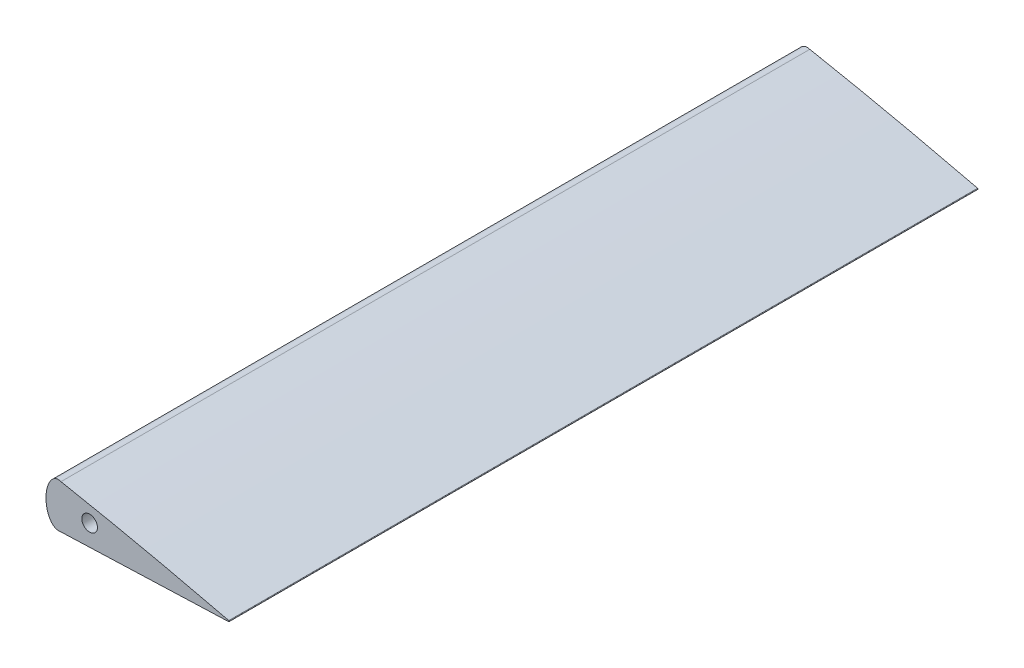
ISO-10303-21;
HEADER;
FILE_DESCRIPTION(('STEP AP214'),'2;1');
FILE_NAME('part.step','',(''),(''),'','','');
FILE_SCHEMA(('AUTOMOTIVE_DESIGN { 1 0 10303 214 1 1 1 1 }'));
ENDSEC;
DATA;
#1=APPLICATION_CONTEXT('core data for automotive mechanical design processes');
#2=APPLICATION_PROTOCOL_DEFINITION('international standard','automotive_design',2000,#1);
#3=PRODUCT_CONTEXT('',#1,'mechanical');
#4=PRODUCT('Part','Part','',(#3));
#5=PRODUCT_RELATED_PRODUCT_CATEGORY('part','',(#4));
#6=PRODUCT_DEFINITION_FORMATION('','',#4);
#7=PRODUCT_DEFINITION_CONTEXT('part definition',#1,'design');
#8=PRODUCT_DEFINITION('design','',#6,#7);
#9=PRODUCT_DEFINITION_SHAPE('','',#8);
#10=(LENGTH_UNIT() NAMED_UNIT(*) SI_UNIT(.MILLI.,.METRE.));
#11=(NAMED_UNIT(*) PLANE_ANGLE_UNIT() SI_UNIT($,.RADIAN.));
#12=(NAMED_UNIT(*) SI_UNIT($,.STERADIAN.) SOLID_ANGLE_UNIT());
#13=UNCERTAINTY_MEASURE_WITH_UNIT(LENGTH_MEASURE(1.E-05),#10,'distance_accuracy_value','');
#14=(GEOMETRIC_REPRESENTATION_CONTEXT(3) GLOBAL_UNCERTAINTY_ASSIGNED_CONTEXT((#13)) GLOBAL_UNIT_ASSIGNED_CONTEXT((#10,
#11,#12)) REPRESENTATION_CONTEXT('',''));
#15=CARTESIAN_POINT('',(0.,0.,0.));
#16=DIRECTION('',(0.,0.,1.));
#17=DIRECTION('',(1.,0.,0.));
#18=AXIS2_PLACEMENT_3D('',#15,#16,#17);
#19=CARTESIAN_POINT('',(164.,0.098236,1246.6));
#20=CARTESIAN_POINT('',(163.453347386671,0.227855350458952,1246.6));
#21=CARTESIAN_POINT('',(162.360115671758,0.487076620664547,1246.6));
#22=CARTESIAN_POINT('',(160.720174081031,0.8748027913242,1246.6));
#23=CARTESIAN_POINT('',(159.080335299599,1.2611135108875,1246.6));
#24=CARTESIAN_POINT('',(156.894331895889,1.77189659204999,1246.6));
#25=CARTESIAN_POINT('',(154.161962419369,2.40100802385925,1246.6));
#26=CARTESIAN_POINT('',(150.881840500926,3.1375256901344,1246.6));
#27=CARTESIAN_POINT('',(147.601664877829,3.85659449964915,1246.6));
#28=CARTESIAN_POINT('',(144.321701501382,4.55985226737601,1246.6));
#29=CARTESIAN_POINT('',(141.041699291482,5.24621809732109,1246.6));
#30=CARTESIAN_POINT('',(137.761756820069,5.91557197661805,1246.6));
#31=CARTESIAN_POINT('',(134.481686048208,6.56653427941028,1246.6));
#32=CARTESIAN_POINT('',(131.201761117117,7.19989778417141,1246.6));
#33=CARTESIAN_POINT('',(127.921667907918,7.81375356606383,1246.6));
#34=CARTESIAN_POINT('',(124.641700877236,8.40917183607385,1246.6));
#35=CARTESIAN_POINT('',(121.361597548386,8.98464976190136,1246.6));
#36=CARTESIAN_POINT('',(118.081600920828,9.54128435164297,1246.6));
#37=CARTESIAN_POINT('',(114.801560540038,10.0780590298297,1246.6));
#38=CARTESIAN_POINT('',(111.521600724131,10.5950345799163,1246.6));
#39=CARTESIAN_POINT('',(108.241713881351,11.0909646842955,1246.6));
#40=CARTESIAN_POINT('',(104.961715387484,11.5629261888805,1246.6));
#41=CARTESIAN_POINT('',(101.681785544589,12.0101669419683,1246.6));
#42=CARTESIAN_POINT('',(98.4017469245326,12.4297089334238,1246.6));
#43=CARTESIAN_POINT('',(95.1216630030627,12.8204998785934,1246.6));
#44=CARTESIAN_POINT('',(91.8415424202874,13.1818311954848,1246.6));
#45=CARTESIAN_POINT('',(88.5614135801748,13.5136296911863,1246.6));
#46=CARTESIAN_POINT('',(85.2812830129089,13.815893693455,1246.6));
#47=CARTESIAN_POINT('',(82.0011692178232,14.0886945475444,1246.6));
#48=CARTESIAN_POINT('',(78.721094583004,14.3317408411769,1246.6));
#49=CARTESIAN_POINT('',(75.4410212023817,14.5431745258036,1246.6));
#50=CARTESIAN_POINT('',(72.1608949429442,14.7199129290163,1246.6));
#51=CARTESIAN_POINT('',(68.8807258367621,14.8594278594699,1246.6));
#52=CARTESIAN_POINT('',(65.6005029177586,14.9591611868157,1246.6));
#53=CARTESIAN_POINT('',(62.3202248877231,15.0161184911894,1246.6));
#54=CARTESIAN_POINT('',(59.0399904849592,15.0330111129914,1246.6));
#55=CARTESIAN_POINT('',(55.7598149007794,15.012803506004,1246.6));
#56=CARTESIAN_POINT('',(52.4796814465771,14.9596338867567,1246.6));
#57=CARTESIAN_POINT('',(49.1996020231385,14.8756453845849,1246.6));
#58=CARTESIAN_POINT('',(45.9192330465041,14.7668246976276,1246.6));
#59=CARTESIAN_POINT('',(42.6385376039657,14.6188266715463,1246.6));
#60=CARTESIAN_POINT('',(39.3574161799392,14.4160226283782,1246.6));
#61=CARTESIAN_POINT('',(36.0757975000136,14.1416033611045,1246.6));
#62=CARTESIAN_POINT('',(32.7935336386632,13.7797355777745,1246.6));
#63=CARTESIAN_POINT('',(29.5117490863587,13.311848816541,1246.6));
#64=CARTESIAN_POINT('',(26.2304347877456,12.7369411502886,1246.6));
#65=CARTESIAN_POINT('',(22.9482106391067,12.0590867159985,1246.6));
#66=CARTESIAN_POINT('',(19.6639743780453,11.2714313088833,1246.6));
#67=CARTESIAN_POINT('',(16.3781154279843,10.3517379968201,1246.6));
#68=CARTESIAN_POINT('',(13.0927390351379,9.27164991130654,1246.6));
#69=CARTESIAN_POINT('',(10.3581556975564,8.23985590536731,1246.6));
#70=CARTESIAN_POINT('',(8.17874341440028,7.26915270171108,1246.6));
#71=CARTESIAN_POINT('',(6.52711920655236,6.42362871815544,1246.6));
#72=CARTESIAN_POINT('',(4.8606326051585,5.41901455288728,1246.6));
#73=CARTESIAN_POINT('',(3.32216784213193,4.2467281999024,1246.6));
#74=CARTESIAN_POINT('',(2.16677990383352,3.13421853144612,1246.6));
#75=CARTESIAN_POINT('',(1.28484362701116,2.24003834899123,1246.6));
#76=CARTESIAN_POINT('',(0.72477847607304,1.58632625202643,1246.6));
#77=CARTESIAN_POINT('',(0.35648721556683,1.02371456627432,1246.6));
#78=CARTESIAN_POINT('',(0.176338644180926,0.655158851073157,1246.6));
#79=CARTESIAN_POINT('',(0.0612611395106372,0.337632955086773,1246.6));
#80=CARTESIAN_POINT('',(-0.0429121865202662,-0.121140296790297,1246.6));
#81=CARTESIAN_POINT('',(0.010077208925072,-0.598533270573657,1246.6));
#82=CARTESIAN_POINT('',(0.176198667745624,-1.01407787652228,1246.6));
#83=CARTESIAN_POINT('',(0.354673421549138,-1.34452507475123,1246.6));
#84=CARTESIAN_POINT('',(0.717110179714685,-1.82624030553599,1246.6));
#85=CARTESIAN_POINT('',(1.26977260153434,-2.33677484867151,1246.6));
#86=CARTESIAN_POINT('',(2.13175393776129,-2.92020441398472,1246.6));
#87=CARTESIAN_POINT('',(3.35494447776376,-3.3927891066928,1246.6));
#88=CARTESIAN_POINT('',(4.91531848514269,-3.70716670555496,1246.6));
#89=CARTESIAN_POINT('',(6.55415647727891,-4.03304969461932,1246.6));
#90=CARTESIAN_POINT('',(8.19533877766632,-4.28351567057608,1246.6));
#91=CARTESIAN_POINT('',(10.3822695733583,-4.51540047764127,1246.6));
#92=CARTESIAN_POINT('',(13.1186249251783,-4.67265304154677,1246.6));
#93=CARTESIAN_POINT('',(16.3988579729893,-4.82847557553279,1246.6));
#94=CARTESIAN_POINT('',(19.6794940200121,-4.9221269224633,1246.6));
#95=CARTESIAN_POINT('',(22.9598439452861,-4.96653444382741,1246.6));
#96=CARTESIAN_POINT('',(26.2400949207719,-4.9678853332589,1246.6));
#97=CARTESIAN_POINT('',(29.5202180796211,-4.93284058420912,1246.6));
#98=CARTESIAN_POINT('',(32.8002579900583,-4.8689493564345,1246.6));
#99=CARTESIAN_POINT('',(36.080251417321,-4.78267153882756,1246.6));
#100=CARTESIAN_POINT('',(39.360205991376,-4.67900202490651,1246.6));
#101=CARTESIAN_POINT('',(42.6401302310176,-4.56299213669189,1246.6));
#102=CARTESIAN_POINT('',(45.9200507833793,-4.43994519774915,1246.6));
#103=CARTESIAN_POINT('',(49.1999634238303,-4.31409585740894,1246.6));
#104=CARTESIAN_POINT('',(52.479955348434,-4.19074867403074,1246.6));
#105=CARTESIAN_POINT('',(55.7599812015837,-4.07002215466733,1246.6));
#106=CARTESIAN_POINT('',(59.0399831910091,-3.95007972297037,1246.6));
#107=CARTESIAN_POINT('',(62.3200043820552,-3.83126992795704,1246.6));
#108=CARTESIAN_POINT('',(65.6000091855952,-3.71206420486596,1246.6));
#109=CARTESIAN_POINT('',(68.8800086095087,-3.59232744073866,1246.6));
#110=CARTESIAN_POINT('',(72.1600102889574,-3.47216006055257,1246.6));
#111=CARTESIAN_POINT('',(75.4399983284211,-3.35129455058597,1246.6));
#112=CARTESIAN_POINT('',(78.7200044224965,-3.23070144154958,1246.6));
#113=CARTESIAN_POINT('',(81.9999960438394,-3.10971523913052,1246.6));
#114=CARTESIAN_POINT('',(85.2799973322548,-2.98904612003693,1246.6));
#115=CARTESIAN_POINT('',(88.5599965582764,-2.86848494516658,1246.6));
#116=CARTESIAN_POINT('',(91.8400003924801,-2.74815868844688,1246.6));
#117=CARTESIAN_POINT('',(95.1199998668713,-2.62776837459643,1246.6));
#118=CARTESIAN_POINT('',(98.4000001400348,-2.50739981316743,1246.6));
#119=CARTESIAN_POINT('',(101.67999957299,-2.38700837273386,1246.6));
#120=CARTESIAN_POINT('',(104.960003572939,-2.26668662234937,1246.6));
#121=CARTESIAN_POINT('',(108.240000169761,-2.14610862248626,1246.6));
#122=CARTESIAN_POINT('',(111.519995748018,-2.02550288772255,1246.6));
#123=CARTESIAN_POINT('',(114.80000480859,-1.90526426839036,1246.6));
#124=CARTESIAN_POINT('',(118.079995042267,-1.78456767053152,1246.6));
#125=CARTESIAN_POINT('',(121.360004997696,-1.66435341763084,1246.6));
#126=CARTESIAN_POINT('',(124.639994991596,-1.54365029078787,1246.6));
#127=CARTESIAN_POINT('',(127.920005011275,-1.42343778737223,1246.6));
#128=CARTESIAN_POINT('',(131.199994987952,-1.30273419156792,1246.6));
#129=CARTESIAN_POINT('',(134.480005012271,-1.18252181451118,1246.6));
#130=CARTESIAN_POINT('',(137.759994987609,-1.06181818223221,1246.6));
#131=CARTESIAN_POINT('',(141.040005012646,-0.941605824715075,1246.6));
#132=CARTESIAN_POINT('',(144.319994986453,-0.820902150752307,1246.6));
#133=CARTESIAN_POINT('',(147.600005016897,-0.700689940430646,1246.6));
#134=CARTESIAN_POINT('',(150.879994970606,-0.579985719369323,1246.6));
#135=CARTESIAN_POINT('',(154.160005076031,-0.459775550244729,1246.6));
#136=CARTESIAN_POINT('',(156.893330138421,-0.359182338982628,1246.6));
#137=CARTESIAN_POINT('',(159.080000324789,-0.278972841706895,1246.6));
#138=CARTESIAN_POINT('',(160.719999512133,-0.218762723666091,1246.6));
#139=CARTESIAN_POINT('',(162.360003632975,-0.15863219006814,1246.6));
#140=CARTESIAN_POINT('',(163.453333875564,-0.118368087984547,1246.6));
#141=CARTESIAN_POINT('',(164.,-0.098236,1246.6));
#142=B_SPLINE_CURVE_WITH_KNOTS('',3,(#19,#20,#21,#22,#23,#24,#25,#26,#27,#28,#29,#30,#31,#32,
#33,#34,#35,#36,#37,#38,#39,#40,#41,#42,#43,#44,#45,#46,#47,#48,#49,#50,#51,#52,#53,#54,#55,#56,
#57,#58,#59,#60,#61,#62,#63,#64,#65,#66,#67,#68,#69,#70,#71,#72,#73,#74,#75,#76,#77,#78,#79,#80,
#81,#82,#83,#84,#85,#86,#87,#88,#89,#90,#91,#92,#93,#94,#95,#96,#97,#98,#99,#100,#101,#102,#103,
#104,#105,#106,#107,#108,#109,#110,#111,#112,#113,#114,#115,#116,#117,#118,#119,#120,#121,#122,
#123,#124,#125,#126,#127,#128,#129,#130,#131,#132,#133,#134,#135,#136,#137,#138,#139,#140,#141),
.UNSPECIFIED.,.F.,.F.,(4,1,1,1,1,1,1,1,1,1,1,1,1,1,1,1,1,1,1,1,1,1,1,1,1,1,1,1,1,1,1,1,1,1,1,1,
1,1,1,1,1,1,1,1,1,1,1,1,1,1,1,1,1,1,1,1,1,1,1,1,1,1,1,1,1,1,1,1,1,1,1,1,1,1,1,1,1,1,1,1,1,1,1,1,
1,1,1,1,1,1,1,1,1,1,1,1,1,1,1,1,1,1,1,1,1,1,1,1,1,1,1,1,1,1,1,1,1,1,1,1,4),(0.,
0.00502783507920503,0.0100549940344634,0.0150810297240759,0.0201050549080901,0.0301452607809432,
0.0401736458927437,0.0501907944797704,0.060197679895013,0.0701942255550732,0.0801803766412489,
0.0901559102827991,0.100121105793046,0.110075702815163,0.120020101260909,0.12995427083149,
0.139878706126609,0.149793490904472,0.159698811392375,0.169594433213407,0.179479778460019,
0.189354743837751,0.199219015443769,0.209072795450207,0.218916602866618,0.228751158154273,
0.238577241843568,0.248395636485294,0.258207018047657,0.268011852233636,0.277810604067606,
0.28760402315173,0.297393126728297,0.30717925271197,0.316964017963334,0.326748818989175,
0.336534714870927,0.346322473718417,0.356112722227348,0.365907651807351,0.375711463271153,
0.385530878969925,0.395375762487733,0.405259304622106,0.415192461064141,0.425184025337781,
0.435248335040234,0.445412190892236,0.455710778825161,0.466190958855658,0.471552192168147,
0.477054503678275,0.482786726573929,0.488945835105149,0.494316032866102,0.497126416153154,
0.500187367762256,0.50200086881537,0.50312820232303,0.503849971017213,0.505020136520667,
0.507317904862695,0.507986558007653,0.509023585585765,0.510668218535329,0.513358347504693,
0.515715811851598,0.519949385272463,0.524973187970153,0.529954400275476,0.534903201933464,
0.539824122915189,0.549630394385822,0.559425368878799,0.569214167199772,0.578999733437889,
0.588784364017046,0.598569510856094,0.608355932640458,0.618143879841103,0.627933314763685,
0.637723968115275,0.647515400204077,0.657307127187741,0.667098669129828,0.676889956114584,
0.68668111741491,0.69647218967302,0.706263279690747,0.716054423133804,0.725845620221906,
0.735636871174765,0.745428122127623,0.755219391084224,0.765010642037082,0.774801875010609,
0.784593090029218,0.794384305047826,0.804175520066435,0.813966735085043,0.823757950103652,
0.833549183077179,0.843340416050707,0.853131631069315,0.862922864042843,0.872714079061451,
0.882505312034978,0.892296527053587,0.902087760027114,0.911878975045723,0.92167020801925,
0.931461423037859,0.941252656011386,0.951043871029995,0.960835104003522,0.970626319022131,
0.980417551995658,0.985313159504962,0.990208767014267,0.995104374523571,1.),.UNSPECIFIED.);
#143=DIRECTION('',(0.,0.,-1.));
#144=VECTOR('',#143,1.);
#145=SURFACE_OF_LINEAR_EXTRUSION('',#142,#144);
#146=CARTESIAN_POINT('',(164.,0.098236,0.));
#147=CARTESIAN_POINT('',(163.453347386671,0.227855350458952,0.));
#148=CARTESIAN_POINT('',(162.360115671758,0.487076620664547,0.));
#149=CARTESIAN_POINT('',(160.720174081031,0.8748027913242,0.));
#150=CARTESIAN_POINT('',(159.080335299599,1.2611135108875,0.));
#151=CARTESIAN_POINT('',(156.894331895889,1.77189659204999,0.));
#152=CARTESIAN_POINT('',(154.161962419369,2.40100802385925,0.));
#153=CARTESIAN_POINT('',(150.881840500926,3.1375256901344,0.));
#154=CARTESIAN_POINT('',(147.601664877829,3.85659449964915,0.));
#155=CARTESIAN_POINT('',(144.321701501382,4.55985226737601,0.));
#156=CARTESIAN_POINT('',(141.041699291482,5.24621809732109,0.));
#157=CARTESIAN_POINT('',(137.761756820069,5.91557197661805,0.));
#158=CARTESIAN_POINT('',(134.481686048208,6.56653427941028,0.));
#159=CARTESIAN_POINT('',(131.201761117117,7.19989778417141,0.));
#160=CARTESIAN_POINT('',(127.921667907918,7.81375356606383,0.));
#161=CARTESIAN_POINT('',(124.641700877236,8.40917183607385,0.));
#162=CARTESIAN_POINT('',(121.361597548386,8.98464976190136,0.));
#163=CARTESIAN_POINT('',(118.081600920828,9.54128435164297,0.));
#164=CARTESIAN_POINT('',(114.801560540038,10.0780590298297,0.));
#165=CARTESIAN_POINT('',(111.521600724131,10.5950345799163,0.));
#166=CARTESIAN_POINT('',(108.241713881351,11.0909646842955,0.));
#167=CARTESIAN_POINT('',(104.961715387484,11.5629261888805,0.));
#168=CARTESIAN_POINT('',(101.681785544589,12.0101669419683,0.));
#169=CARTESIAN_POINT('',(98.4017469245326,12.4297089334238,0.));
#170=CARTESIAN_POINT('',(95.1216630030627,12.8204998785934,0.));
#171=CARTESIAN_POINT('',(91.8415424202874,13.1818311954848,0.));
#172=CARTESIAN_POINT('',(88.5614135801748,13.5136296911863,0.));
#173=CARTESIAN_POINT('',(85.2812830129089,13.815893693455,0.));
#174=CARTESIAN_POINT('',(82.0011692178232,14.0886945475444,0.));
#175=CARTESIAN_POINT('',(78.721094583004,14.3317408411769,0.));
#176=CARTESIAN_POINT('',(75.4410212023817,14.5431745258036,0.));
#177=CARTESIAN_POINT('',(72.1608949429442,14.7199129290163,0.));
#178=CARTESIAN_POINT('',(68.8807258367621,14.8594278594699,0.));
#179=CARTESIAN_POINT('',(65.6005029177586,14.9591611868157,0.));
#180=CARTESIAN_POINT('',(62.3202248877231,15.0161184911894,0.));
#181=CARTESIAN_POINT('',(59.0399904849592,15.0330111129914,0.));
#182=CARTESIAN_POINT('',(55.7598149007794,15.012803506004,0.));
#183=CARTESIAN_POINT('',(52.4796814465771,14.9596338867567,0.));
#184=CARTESIAN_POINT('',(49.1996020231385,14.8756453845849,0.));
#185=CARTESIAN_POINT('',(45.9192330465041,14.7668246976276,0.));
#186=CARTESIAN_POINT('',(42.6385376039657,14.6188266715463,0.));
#187=CARTESIAN_POINT('',(39.3574161799392,14.4160226283782,0.));
#188=CARTESIAN_POINT('',(36.0757975000136,14.1416033611045,0.));
#189=CARTESIAN_POINT('',(32.7935336386632,13.7797355777745,0.));
#190=CARTESIAN_POINT('',(29.5117490863587,13.311848816541,0.));
#191=CARTESIAN_POINT('',(26.2304347877456,12.7369411502886,0.));
#192=CARTESIAN_POINT('',(22.9482106391067,12.0590867159985,0.));
#193=CARTESIAN_POINT('',(19.6639743780453,11.2714313088833,0.));
#194=CARTESIAN_POINT('',(16.3781154279843,10.3517379968201,0.));
#195=CARTESIAN_POINT('',(13.0927390351379,9.27164991130654,0.));
#196=CARTESIAN_POINT('',(10.3581556975564,8.23985590536731,0.));
#197=CARTESIAN_POINT('',(8.17874341440028,7.26915270171108,0.));
#198=CARTESIAN_POINT('',(6.52711920655236,6.42362871815544,0.));
#199=CARTESIAN_POINT('',(4.8606326051585,5.41901455288728,0.));
#200=CARTESIAN_POINT('',(3.32216784213193,4.2467281999024,0.));
#201=CARTESIAN_POINT('',(2.16677990383352,3.13421853144612,0.));
#202=CARTESIAN_POINT('',(1.28484362701116,2.24003834899123,0.));
#203=CARTESIAN_POINT('',(0.72477847607304,1.58632625202643,0.));
#204=CARTESIAN_POINT('',(0.35648721556683,1.02371456627432,0.));
#205=CARTESIAN_POINT('',(0.176338644180926,0.655158851073157,0.));
#206=CARTESIAN_POINT('',(0.0612611395106372,0.337632955086773,0.));
#207=CARTESIAN_POINT('',(-0.0429121865202662,-0.121140296790297,0.));
#208=CARTESIAN_POINT('',(0.010077208925072,-0.598533270573657,0.));
#209=CARTESIAN_POINT('',(0.176198667745624,-1.01407787652228,0.));
#210=CARTESIAN_POINT('',(0.354673421549138,-1.34452507475123,0.));
#211=CARTESIAN_POINT('',(0.717110179714685,-1.82624030553599,0.));
#212=CARTESIAN_POINT('',(1.26977260153434,-2.33677484867151,0.));
#213=CARTESIAN_POINT('',(2.13175393776129,-2.92020441398472,0.));
#214=CARTESIAN_POINT('',(3.35494447776376,-3.3927891066928,0.));
#215=CARTESIAN_POINT('',(4.91531848514269,-3.70716670555496,0.));
#216=CARTESIAN_POINT('',(6.55415647727891,-4.03304969461932,0.));
#217=CARTESIAN_POINT('',(8.19533877766632,-4.28351567057608,0.));
#218=CARTESIAN_POINT('',(10.3822695733583,-4.51540047764127,0.));
#219=CARTESIAN_POINT('',(13.1186249251783,-4.67265304154677,0.));
#220=CARTESIAN_POINT('',(16.3988579729893,-4.82847557553279,0.));
#221=CARTESIAN_POINT('',(19.6794940200121,-4.9221269224633,0.));
#222=CARTESIAN_POINT('',(22.9598439452861,-4.96653444382741,0.));
#223=CARTESIAN_POINT('',(26.2400949207719,-4.9678853332589,0.));
#224=CARTESIAN_POINT('',(29.5202180796211,-4.93284058420912,0.));
#225=CARTESIAN_POINT('',(32.8002579900583,-4.8689493564345,0.));
#226=CARTESIAN_POINT('',(36.080251417321,-4.78267153882756,0.));
#227=CARTESIAN_POINT('',(39.360205991376,-4.67900202490651,0.));
#228=CARTESIAN_POINT('',(42.6401302310176,-4.56299213669189,0.));
#229=CARTESIAN_POINT('',(45.9200507833793,-4.43994519774915,0.));
#230=CARTESIAN_POINT('',(49.1999634238303,-4.31409585740894,0.));
#231=CARTESIAN_POINT('',(52.479955348434,-4.19074867403074,0.));
#232=CARTESIAN_POINT('',(55.7599812015837,-4.07002215466733,0.));
#233=CARTESIAN_POINT('',(59.0399831910091,-3.95007972297037,0.));
#234=CARTESIAN_POINT('',(62.3200043820552,-3.83126992795704,0.));
#235=CARTESIAN_POINT('',(65.6000091855952,-3.71206420486596,0.));
#236=CARTESIAN_POINT('',(68.8800086095087,-3.59232744073866,0.));
#237=CARTESIAN_POINT('',(72.1600102889574,-3.47216006055257,0.));
#238=CARTESIAN_POINT('',(75.4399983284211,-3.35129455058597,0.));
#239=CARTESIAN_POINT('',(78.7200044224965,-3.23070144154958,0.));
#240=CARTESIAN_POINT('',(81.9999960438394,-3.10971523913052,0.));
#241=CARTESIAN_POINT('',(85.2799973322548,-2.98904612003693,0.));
#242=CARTESIAN_POINT('',(88.5599965582764,-2.86848494516658,0.));
#243=CARTESIAN_POINT('',(91.8400003924801,-2.74815868844688,0.));
#244=CARTESIAN_POINT('',(95.1199998668713,-2.62776837459643,0.));
#245=CARTESIAN_POINT('',(98.4000001400348,-2.50739981316743,0.));
#246=CARTESIAN_POINT('',(101.67999957299,-2.38700837273386,0.));
#247=CARTESIAN_POINT('',(104.960003572939,-2.26668662234937,0.));
#248=CARTESIAN_POINT('',(108.240000169761,-2.14610862248626,0.));
#249=CARTESIAN_POINT('',(111.519995748018,-2.02550288772255,0.));
#250=CARTESIAN_POINT('',(114.80000480859,-1.90526426839036,0.));
#251=CARTESIAN_POINT('',(118.079995042267,-1.78456767053152,0.));
#252=CARTESIAN_POINT('',(121.360004997696,-1.66435341763084,0.));
#253=CARTESIAN_POINT('',(124.639994991596,-1.54365029078787,0.));
#254=CARTESIAN_POINT('',(127.920005011275,-1.42343778737223,0.));
#255=CARTESIAN_POINT('',(131.199994987952,-1.30273419156792,0.));
#256=CARTESIAN_POINT('',(134.480005012271,-1.18252181451118,0.));
#257=CARTESIAN_POINT('',(137.759994987609,-1.06181818223221,0.));
#258=CARTESIAN_POINT('',(141.040005012646,-0.941605824715075,0.));
#259=CARTESIAN_POINT('',(144.319994986453,-0.820902150752307,0.));
#260=CARTESIAN_POINT('',(147.600005016897,-0.700689940430646,0.));
#261=CARTESIAN_POINT('',(150.879994970606,-0.579985719369323,0.));
#262=CARTESIAN_POINT('',(154.160005076031,-0.459775550244729,0.));
#263=CARTESIAN_POINT('',(156.893330138421,-0.359182338982628,0.));
#264=CARTESIAN_POINT('',(159.080000324789,-0.278972841706895,0.));
#265=CARTESIAN_POINT('',(160.719999512133,-0.218762723666091,0.));
#266=CARTESIAN_POINT('',(162.360003632975,-0.15863219006814,0.));
#267=CARTESIAN_POINT('',(163.453333875564,-0.118368087984547,0.));
#268=CARTESIAN_POINT('',(164.,-0.098236,0.));
#269=B_SPLINE_CURVE_WITH_KNOTS('',3,(#146,#147,#148,#149,#150,#151,#152,#153,#154,#155,#156,
#157,#158,#159,#160,#161,#162,#163,#164,#165,#166,#167,#168,#169,#170,#171,#172,#173,#174,#175,
#176,#177,#178,#179,#180,#181,#182,#183,#184,#185,#186,#187,#188,#189,#190,#191,#192,#193,#194,
#195,#196,#197,#198,#199,#200,#201,#202,#203,#204,#205,#206,#207,#208,#209,#210,#211,#212,#213,
#214,#215,#216,#217,#218,#219,#220,#221,#222,#223,#224,#225,#226,#227,#228,#229,#230,#231,#232,
#233,#234,#235,#236,#237,#238,#239,#240,#241,#242,#243,#244,#245,#246,#247,#248,#249,#250,#251,
#252,#253,#254,#255,#256,#257,#258,#259,#260,#261,#262,#263,#264,#265,#266,#267,#268),
.UNSPECIFIED.,.F.,.F.,(4,1,1,1,1,1,1,1,1,1,1,1,1,1,1,1,1,1,1,1,1,1,1,1,1,1,1,1,1,1,1,1,1,1,1,1,
1,1,1,1,1,1,1,1,1,1,1,1,1,1,1,1,1,1,1,1,1,1,1,1,1,1,1,1,1,1,1,1,1,1,1,1,1,1,1,1,1,1,1,1,1,1,1,1,
1,1,1,1,1,1,1,1,1,1,1,1,1,1,1,1,1,1,1,1,1,1,1,1,1,1,1,1,1,1,1,1,1,1,1,1,4),(0.,
0.00502783507920503,0.0100549940344634,0.0150810297240759,0.0201050549080901,0.0301452607809432,
0.0401736458927437,0.0501907944797704,0.060197679895013,0.0701942255550732,0.0801803766412489,
0.0901559102827991,0.100121105793046,0.110075702815163,0.120020101260909,0.12995427083149,
0.139878706126609,0.149793490904472,0.159698811392375,0.169594433213407,0.179479778460019,
0.189354743837751,0.199219015443769,0.209072795450207,0.218916602866618,0.228751158154273,
0.238577241843568,0.248395636485294,0.258207018047657,0.268011852233636,0.277810604067606,
0.28760402315173,0.297393126728297,0.30717925271197,0.316964017963334,0.326748818989175,
0.336534714870927,0.346322473718417,0.356112722227348,0.365907651807351,0.375711463271153,
0.385530878969925,0.395375762487733,0.405259304622106,0.415192461064141,0.425184025337781,
0.435248335040234,0.445412190892236,0.455710778825161,0.466190958855658,0.471552192168147,
0.477054503678275,0.482786726573929,0.488945835105149,0.494316032866102,0.497126416153154,
0.500187367762256,0.50200086881537,0.50312820232303,0.503849971017213,0.505020136520667,
0.507317904862695,0.507986558007653,0.509023585585765,0.510668218535329,0.513358347504693,
0.515715811851598,0.519949385272463,0.524973187970153,0.529954400275476,0.534903201933464,
0.539824122915189,0.549630394385822,0.559425368878799,0.569214167199772,0.578999733437889,
0.588784364017046,0.598569510856094,0.608355932640458,0.618143879841103,0.627933314763685,
0.637723968115275,0.647515400204077,0.657307127187741,0.667098669129828,0.676889956114584,
0.68668111741491,0.69647218967302,0.706263279690747,0.716054423133804,0.725845620221906,
0.735636871174765,0.745428122127623,0.755219391084224,0.765010642037082,0.774801875010609,
0.784593090029218,0.794384305047826,0.804175520066435,0.813966735085043,0.823757950103652,
0.833549183077179,0.843340416050707,0.853131631069315,0.862922864042843,0.872714079061451,
0.882505312034978,0.892296527053587,0.902087760027114,0.911878975045723,0.92167020801925,
0.931461423037859,0.941252656011386,0.951043871029995,0.960835104003522,0.970626319022131,
0.980417551995658,0.985313159504962,0.990208767014267,0.995104374523571,1.),.UNSPECIFIED.);
#270=CARTESIAN_POINT('',(164.,0.098236,0.));
#271=VERTEX_POINT('',#270);
#272=CARTESIAN_POINT('',(131.781518308133,7.08611175598654,0.));
#273=VERTEX_POINT('',#272);
#274=EDGE_CURVE('E59',#271,#273,#269,.T.);
#275=ORIENTED_EDGE('',*,*,#274,.T.);
#276=DIRECTION('',(0.,0.,-1.));
#277=VECTOR('',#276,1.);
#278=CARTESIAN_POINT('',(131.781518308133,7.08611175598655,143.8));
#279=LINE('',#278,#277);
#280=CARTESIAN_POINT('',(131.781518308133,7.08611175598666,143.8));
#281=VERTEX_POINT('',#280);
#282=EDGE_CURVE('E89',#273,#281,#279,.F.);
#283=ORIENTED_EDGE('',*,*,#282,.T.);
#284=CARTESIAN_POINT('',(164.,0.098236,143.8));
#285=CARTESIAN_POINT('',(163.453347386671,0.227855350458952,143.8));
#286=CARTESIAN_POINT('',(162.360115671758,0.487076620664547,143.8));
#287=CARTESIAN_POINT('',(160.720174081031,0.8748027913242,143.8));
#288=CARTESIAN_POINT('',(159.080335299599,1.2611135108875,143.8));
#289=CARTESIAN_POINT('',(156.894331895889,1.77189659204999,143.8));
#290=CARTESIAN_POINT('',(154.161962419369,2.40100802385925,143.8));
#291=CARTESIAN_POINT('',(150.881840500926,3.1375256901344,143.8));
#292=CARTESIAN_POINT('',(147.601664877829,3.85659449964915,143.8));
#293=CARTESIAN_POINT('',(144.321701501382,4.55985226737601,143.8));
#294=CARTESIAN_POINT('',(141.041699291482,5.24621809732109,143.8));
#295=CARTESIAN_POINT('',(137.761756820069,5.91557197661805,143.8));
#296=CARTESIAN_POINT('',(134.481686048208,6.56653427941028,143.8));
#297=CARTESIAN_POINT('',(131.201761117117,7.19989778417141,143.8));
#298=CARTESIAN_POINT('',(127.921667907918,7.81375356606383,143.8));
#299=CARTESIAN_POINT('',(124.641700877236,8.40917183607385,143.8));
#300=CARTESIAN_POINT('',(121.361597548386,8.98464976190136,143.8));
#301=CARTESIAN_POINT('',(118.081600920828,9.54128435164297,143.8));
#302=CARTESIAN_POINT('',(114.801560540038,10.0780590298297,143.8));
#303=CARTESIAN_POINT('',(111.521600724131,10.5950345799163,143.8));
#304=CARTESIAN_POINT('',(108.241713881351,11.0909646842955,143.8));
#305=CARTESIAN_POINT('',(104.961715387484,11.5629261888805,143.8));
#306=CARTESIAN_POINT('',(101.681785544589,12.0101669419683,143.8));
#307=CARTESIAN_POINT('',(98.4017469245326,12.4297089334238,143.8));
#308=CARTESIAN_POINT('',(95.1216630030627,12.8204998785934,143.8));
#309=CARTESIAN_POINT('',(91.8415424202874,13.1818311954848,143.8));
#310=CARTESIAN_POINT('',(88.5614135801748,13.5136296911863,143.8));
#311=CARTESIAN_POINT('',(85.2812830129089,13.815893693455,143.8));
#312=CARTESIAN_POINT('',(82.0011692178232,14.0886945475444,143.8));
#313=CARTESIAN_POINT('',(78.721094583004,14.3317408411769,143.8));
#314=CARTESIAN_POINT('',(75.4410212023817,14.5431745258036,143.8));
#315=CARTESIAN_POINT('',(72.1608949429442,14.7199129290163,143.8));
#316=CARTESIAN_POINT('',(68.8807258367621,14.8594278594699,143.8));
#317=CARTESIAN_POINT('',(65.6005029177586,14.9591611868157,143.8));
#318=CARTESIAN_POINT('',(62.3202248877231,15.0161184911894,143.8));
#319=CARTESIAN_POINT('',(59.0399904849592,15.0330111129914,143.8));
#320=CARTESIAN_POINT('',(55.7598149007794,15.012803506004,143.8));
#321=CARTESIAN_POINT('',(52.4796814465771,14.9596338867567,143.8));
#322=CARTESIAN_POINT('',(49.1996020231385,14.8756453845849,143.8));
#323=CARTESIAN_POINT('',(45.9192330465041,14.7668246976276,143.8));
#324=CARTESIAN_POINT('',(42.6385376039657,14.6188266715463,143.8));
#325=CARTESIAN_POINT('',(39.3574161799392,14.4160226283782,143.8));
#326=CARTESIAN_POINT('',(36.0757975000136,14.1416033611045,143.8));
#327=CARTESIAN_POINT('',(32.7935336386632,13.7797355777745,143.8));
#328=CARTESIAN_POINT('',(29.5117490863587,13.311848816541,143.8));
#329=CARTESIAN_POINT('',(26.2304347877456,12.7369411502886,143.8));
#330=CARTESIAN_POINT('',(22.9482106391067,12.0590867159985,143.8));
#331=CARTESIAN_POINT('',(19.6639743780453,11.2714313088833,143.8));
#332=CARTESIAN_POINT('',(16.3781154279843,10.3517379968201,143.8));
#333=CARTESIAN_POINT('',(13.0927390351379,9.27164991130654,143.8));
#334=CARTESIAN_POINT('',(10.3581556975564,8.23985590536731,143.8));
#335=CARTESIAN_POINT('',(8.17874341440028,7.26915270171108,143.8));
#336=CARTESIAN_POINT('',(6.52711920655236,6.42362871815544,143.8));
#337=CARTESIAN_POINT('',(4.8606326051585,5.41901455288728,143.8));
#338=CARTESIAN_POINT('',(3.32216784213193,4.2467281999024,143.8));
#339=CARTESIAN_POINT('',(2.16677990383352,3.13421853144612,143.8));
#340=CARTESIAN_POINT('',(1.28484362701116,2.24003834899123,143.8));
#341=CARTESIAN_POINT('',(0.72477847607304,1.58632625202643,143.8));
#342=CARTESIAN_POINT('',(0.35648721556683,1.02371456627432,143.8));
#343=CARTESIAN_POINT('',(0.176338644180926,0.655158851073157,143.8));
#344=CARTESIAN_POINT('',(0.0612611395106372,0.337632955086773,143.8));
#345=CARTESIAN_POINT('',(-0.0429121865202662,-0.121140296790297,143.8));
#346=CARTESIAN_POINT('',(0.010077208925072,-0.598533270573657,143.8));
#347=CARTESIAN_POINT('',(0.176198667745624,-1.01407787652228,143.8));
#348=CARTESIAN_POINT('',(0.354673421549138,-1.34452507475123,143.8));
#349=CARTESIAN_POINT('',(0.717110179714685,-1.82624030553599,143.8));
#350=CARTESIAN_POINT('',(1.26977260153434,-2.33677484867151,143.8));
#351=CARTESIAN_POINT('',(2.13175393776129,-2.92020441398472,143.8));
#352=CARTESIAN_POINT('',(3.35494447776376,-3.3927891066928,143.8));
#353=CARTESIAN_POINT('',(4.91531848514269,-3.70716670555496,143.8));
#354=CARTESIAN_POINT('',(6.55415647727891,-4.03304969461932,143.8));
#355=CARTESIAN_POINT('',(8.19533877766632,-4.28351567057608,143.8));
#356=CARTESIAN_POINT('',(10.3822695733583,-4.51540047764127,143.8));
#357=CARTESIAN_POINT('',(13.1186249251783,-4.67265304154677,143.8));
#358=CARTESIAN_POINT('',(16.3988579729893,-4.82847557553279,143.8));
#359=CARTESIAN_POINT('',(19.6794940200121,-4.9221269224633,143.8));
#360=CARTESIAN_POINT('',(22.9598439452861,-4.96653444382741,143.8));
#361=CARTESIAN_POINT('',(26.2400949207719,-4.9678853332589,143.8));
#362=CARTESIAN_POINT('',(29.5202180796211,-4.93284058420912,143.8));
#363=CARTESIAN_POINT('',(32.8002579900583,-4.8689493564345,143.8));
#364=CARTESIAN_POINT('',(36.080251417321,-4.78267153882756,143.8));
#365=CARTESIAN_POINT('',(39.360205991376,-4.67900202490651,143.8));
#366=CARTESIAN_POINT('',(42.6401302310176,-4.56299213669189,143.8));
#367=CARTESIAN_POINT('',(45.9200507833793,-4.43994519774915,143.8));
#368=CARTESIAN_POINT('',(49.1999634238303,-4.31409585740894,143.8));
#369=CARTESIAN_POINT('',(52.479955348434,-4.19074867403074,143.8));
#370=CARTESIAN_POINT('',(55.7599812015837,-4.07002215466733,143.8));
#371=CARTESIAN_POINT('',(59.0399831910091,-3.95007972297037,143.8));
#372=CARTESIAN_POINT('',(62.3200043820552,-3.83126992795704,143.8));
#373=CARTESIAN_POINT('',(65.6000091855952,-3.71206420486596,143.8));
#374=CARTESIAN_POINT('',(68.8800086095087,-3.59232744073866,143.8));
#375=CARTESIAN_POINT('',(72.1600102889574,-3.47216006055257,143.8));
#376=CARTESIAN_POINT('',(75.4399983284211,-3.35129455058597,143.8));
#377=CARTESIAN_POINT('',(78.7200044224965,-3.23070144154958,143.8));
#378=CARTESIAN_POINT('',(81.9999960438394,-3.10971523913052,143.8));
#379=CARTESIAN_POINT('',(85.2799973322548,-2.98904612003693,143.8));
#380=CARTESIAN_POINT('',(88.5599965582764,-2.86848494516658,143.8));
#381=CARTESIAN_POINT('',(91.8400003924801,-2.74815868844688,143.8));
#382=CARTESIAN_POINT('',(95.1199998668713,-2.62776837459643,143.8));
#383=CARTESIAN_POINT('',(98.4000001400348,-2.50739981316743,143.8));
#384=CARTESIAN_POINT('',(101.67999957299,-2.38700837273386,143.8));
#385=CARTESIAN_POINT('',(104.960003572939,-2.26668662234937,143.8));
#386=CARTESIAN_POINT('',(108.240000169761,-2.14610862248626,143.8));
#387=CARTESIAN_POINT('',(111.519995748018,-2.02550288772255,143.8));
#388=CARTESIAN_POINT('',(114.80000480859,-1.90526426839036,143.8));
#389=CARTESIAN_POINT('',(118.079995042267,-1.78456767053152,143.8));
#390=CARTESIAN_POINT('',(121.360004997696,-1.66435341763084,143.8));
#391=CARTESIAN_POINT('',(124.639994991596,-1.54365029078787,143.8));
#392=CARTESIAN_POINT('',(127.920005011275,-1.42343778737223,143.8));
#393=CARTESIAN_POINT('',(131.199994987952,-1.30273419156792,143.8));
#394=CARTESIAN_POINT('',(134.480005012271,-1.18252181451118,143.8));
#395=CARTESIAN_POINT('',(137.759994987609,-1.06181818223221,143.8));
#396=CARTESIAN_POINT('',(141.040005012646,-0.941605824715075,143.8));
#397=CARTESIAN_POINT('',(144.319994986453,-0.820902150752307,143.8));
#398=CARTESIAN_POINT('',(147.600005016897,-0.700689940430646,143.8));
#399=CARTESIAN_POINT('',(150.879994970606,-0.579985719369323,143.8));
#400=CARTESIAN_POINT('',(154.160005076031,-0.459775550244729,143.8));
#401=CARTESIAN_POINT('',(156.893330138421,-0.359182338982628,143.8));
#402=CARTESIAN_POINT('',(159.080000324789,-0.278972841706895,143.8));
#403=CARTESIAN_POINT('',(160.719999512133,-0.218762723666091,143.8));
#404=CARTESIAN_POINT('',(162.360003632975,-0.15863219006814,143.8));
#405=CARTESIAN_POINT('',(163.453333875564,-0.118368087984547,143.8));
#406=CARTESIAN_POINT('',(164.,-0.098236,143.8));
#407=B_SPLINE_CURVE_WITH_KNOTS('',3,(#284,#285,#286,#287,#288,#289,#290,#291,#292,#293,#294,
#295,#296,#297,#298,#299,#300,#301,#302,#303,#304,#305,#306,#307,#308,#309,#310,#311,#312,#313,
#314,#315,#316,#317,#318,#319,#320,#321,#322,#323,#324,#325,#326,#327,#328,#329,#330,#331,#332,
#333,#334,#335,#336,#337,#338,#339,#340,#341,#342,#343,#344,#345,#346,#347,#348,#349,#350,#351,
#352,#353,#354,#355,#356,#357,#358,#359,#360,#361,#362,#363,#364,#365,#366,#367,#368,#369,#370,
#371,#372,#373,#374,#375,#376,#377,#378,#379,#380,#381,#382,#383,#384,#385,#386,#387,#388,#389,
#390,#391,#392,#393,#394,#395,#396,#397,#398,#399,#400,#401,#402,#403,#404,#405,#406),
.UNSPECIFIED.,.F.,.F.,(4,1,1,1,1,1,1,1,1,1,1,1,1,1,1,1,1,1,1,1,1,1,1,1,1,1,1,1,1,1,1,1,1,1,1,1,
1,1,1,1,1,1,1,1,1,1,1,1,1,1,1,1,1,1,1,1,1,1,1,1,1,1,1,1,1,1,1,1,1,1,1,1,1,1,1,1,1,1,1,1,1,1,1,1,
1,1,1,1,1,1,1,1,1,1,1,1,1,1,1,1,1,1,1,1,1,1,1,1,1,1,1,1,1,1,1,1,1,1,1,1,4),(0.,
0.00502783507920503,0.0100549940344634,0.0150810297240759,0.0201050549080901,0.0301452607809432,
0.0401736458927437,0.0501907944797704,0.060197679895013,0.0701942255550732,0.0801803766412489,
0.0901559102827991,0.100121105793046,0.110075702815163,0.120020101260909,0.12995427083149,
0.139878706126609,0.149793490904472,0.159698811392375,0.169594433213407,0.179479778460019,
0.189354743837751,0.199219015443769,0.209072795450207,0.218916602866618,0.228751158154273,
0.238577241843568,0.248395636485294,0.258207018047657,0.268011852233636,0.277810604067606,
0.28760402315173,0.297393126728297,0.30717925271197,0.316964017963334,0.326748818989175,
0.336534714870927,0.346322473718417,0.356112722227348,0.365907651807351,0.375711463271153,
0.385530878969925,0.395375762487733,0.405259304622106,0.415192461064141,0.425184025337781,
0.435248335040234,0.445412190892236,0.455710778825161,0.466190958855658,0.471552192168147,
0.477054503678275,0.482786726573929,0.488945835105149,0.494316032866102,0.497126416153154,
0.500187367762256,0.50200086881537,0.50312820232303,0.503849971017213,0.505020136520667,
0.507317904862695,0.507986558007653,0.509023585585765,0.510668218535329,0.513358347504693,
0.515715811851598,0.519949385272463,0.524973187970153,0.529954400275476,0.534903201933464,
0.539824122915189,0.549630394385822,0.559425368878799,0.569214167199772,0.578999733437889,
0.588784364017046,0.598569510856094,0.608355932640458,0.618143879841103,0.627933314763685,
0.637723968115275,0.647515400204077,0.657307127187741,0.667098669129828,0.676889956114584,
0.68668111741491,0.69647218967302,0.706263279690747,0.716054423133804,0.725845620221906,
0.735636871174765,0.745428122127623,0.755219391084224,0.765010642037082,0.774801875010609,
0.784593090029218,0.794384305047826,0.804175520066435,0.813966735085043,0.823757950103652,
0.833549183077179,0.843340416050707,0.853131631069315,0.862922864042843,0.872714079061451,
0.882505312034978,0.892296527053587,0.902087760027114,0.911878975045723,0.92167020801925,
0.931461423037859,0.941252656011386,0.951043871029995,0.960835104003522,0.970626319022131,
0.980417551995658,0.985313159504962,0.990208767014267,0.995104374523571,1.),.UNSPECIFIED.);
#408=CARTESIAN_POINT('',(164.,0.098236,143.8));
#409=VERTEX_POINT('',#408);
#410=EDGE_CURVE('E213',#409,#281,#407,.T.);
#411=ORIENTED_EDGE('',*,*,#410,.F.);
#412=DIRECTION('',(0.,0.,-1.));
#413=VECTOR('',#412,1.);
#414=CARTESIAN_POINT('',(164.,0.098236,1246.6));
#415=LINE('',#414,#413);
#416=EDGE_CURVE('E43',#409,#271,#415,.T.);
#417=ORIENTED_EDGE('',*,*,#416,.T.);
#418=EDGE_LOOP('',(#275,#283,#411,#417));
#419=FACE_BOUND('',#418,.T.);
#420=ADVANCED_FACE('F33',(#419),#145,.F.);
#421=CARTESIAN_POINT('',(164.,0.098236,143.8));
#422=CARTESIAN_POINT('',(163.453347386671,0.227855350458952,143.8));
#423=CARTESIAN_POINT('',(162.360115671758,0.487076620664547,143.8));
#424=CARTESIAN_POINT('',(160.720174081031,0.8748027913242,143.8));
#425=CARTESIAN_POINT('',(159.080335299599,1.2611135108875,143.8));
#426=CARTESIAN_POINT('',(156.894331895889,1.77189659204999,143.8));
#427=CARTESIAN_POINT('',(154.161962419369,2.40100802385925,143.8));
#428=CARTESIAN_POINT('',(150.881840500926,3.1375256901344,143.8));
#429=CARTESIAN_POINT('',(147.601664877829,3.85659449964915,143.8));
#430=CARTESIAN_POINT('',(144.321701501382,4.55985226737601,143.8));
#431=CARTESIAN_POINT('',(141.041699291482,5.24621809732109,143.8));
#432=CARTESIAN_POINT('',(137.761756820069,5.91557197661805,143.8));
#433=CARTESIAN_POINT('',(134.481686048208,6.56653427941028,143.8));
#434=CARTESIAN_POINT('',(131.201761117117,7.19989778417141,143.8));
#435=CARTESIAN_POINT('',(127.921667907918,7.81375356606383,143.8));
#436=CARTESIAN_POINT('',(124.641700877236,8.40917183607385,143.8));
#437=CARTESIAN_POINT('',(121.361597548386,8.98464976190136,143.8));
#438=CARTESIAN_POINT('',(118.081600920828,9.54128435164297,143.8));
#439=CARTESIAN_POINT('',(114.801560540038,10.0780590298297,143.8));
#440=CARTESIAN_POINT('',(111.521600724131,10.5950345799163,143.8));
#441=CARTESIAN_POINT('',(108.241713881351,11.0909646842955,143.8));
#442=CARTESIAN_POINT('',(104.961715387484,11.5629261888805,143.8));
#443=CARTESIAN_POINT('',(101.681785544589,12.0101669419683,143.8));
#444=CARTESIAN_POINT('',(98.4017469245326,12.4297089334238,143.8));
#445=CARTESIAN_POINT('',(95.1216630030627,12.8204998785934,143.8));
#446=CARTESIAN_POINT('',(91.8415424202874,13.1818311954848,143.8));
#447=CARTESIAN_POINT('',(88.5614135801748,13.5136296911863,143.8));
#448=CARTESIAN_POINT('',(85.2812830129089,13.815893693455,143.8));
#449=CARTESIAN_POINT('',(82.0011692178232,14.0886945475444,143.8));
#450=CARTESIAN_POINT('',(78.721094583004,14.3317408411769,143.8));
#451=CARTESIAN_POINT('',(75.4410212023817,14.5431745258036,143.8));
#452=CARTESIAN_POINT('',(72.1608949429442,14.7199129290163,143.8));
#453=CARTESIAN_POINT('',(68.8807258367621,14.8594278594699,143.8));
#454=CARTESIAN_POINT('',(65.6005029177586,14.9591611868157,143.8));
#455=CARTESIAN_POINT('',(62.3202248877231,15.0161184911894,143.8));
#456=CARTESIAN_POINT('',(59.0399904849592,15.0330111129914,143.8));
#457=CARTESIAN_POINT('',(55.7598149007794,15.012803506004,143.8));
#458=CARTESIAN_POINT('',(52.4796814465771,14.9596338867567,143.8));
#459=CARTESIAN_POINT('',(49.1996020231385,14.8756453845849,143.8));
#460=CARTESIAN_POINT('',(45.9192330465041,14.7668246976276,143.8));
#461=CARTESIAN_POINT('',(42.6385376039657,14.6188266715463,143.8));
#462=CARTESIAN_POINT('',(39.3574161799392,14.4160226283782,143.8));
#463=CARTESIAN_POINT('',(36.0757975000136,14.1416033611045,143.8));
#464=CARTESIAN_POINT('',(32.7935336386632,13.7797355777745,143.8));
#465=CARTESIAN_POINT('',(29.5117490863587,13.311848816541,143.8));
#466=CARTESIAN_POINT('',(26.2304347877456,12.7369411502886,143.8));
#467=CARTESIAN_POINT('',(22.9482106391067,12.0590867159985,143.8));
#468=CARTESIAN_POINT('',(19.6639743780453,11.2714313088833,143.8));
#469=CARTESIAN_POINT('',(16.3781154279843,10.3517379968201,143.8));
#470=CARTESIAN_POINT('',(13.0927390351379,9.27164991130654,143.8));
#471=CARTESIAN_POINT('',(10.3581556975564,8.23985590536731,143.8));
#472=CARTESIAN_POINT('',(8.17874341440028,7.26915270171108,143.8));
#473=CARTESIAN_POINT('',(6.52711920655236,6.42362871815544,143.8));
#474=CARTESIAN_POINT('',(4.8606326051585,5.41901455288728,143.8));
#475=CARTESIAN_POINT('',(3.32216784213193,4.2467281999024,143.8));
#476=CARTESIAN_POINT('',(2.16677990383352,3.13421853144612,143.8));
#477=CARTESIAN_POINT('',(1.28484362701116,2.24003834899123,143.8));
#478=CARTESIAN_POINT('',(0.72477847607304,1.58632625202643,143.8));
#479=CARTESIAN_POINT('',(0.35648721556683,1.02371456627432,143.8));
#480=CARTESIAN_POINT('',(0.176338644180926,0.655158851073157,143.8));
#481=CARTESIAN_POINT('',(0.0612611395106372,0.337632955086773,143.8));
#482=CARTESIAN_POINT('',(-0.0429121865202662,-0.121140296790297,143.8));
#483=CARTESIAN_POINT('',(0.010077208925072,-0.598533270573657,143.8));
#484=CARTESIAN_POINT('',(0.176198667745624,-1.01407787652228,143.8));
#485=CARTESIAN_POINT('',(0.354673421549138,-1.34452507475123,143.8));
#486=CARTESIAN_POINT('',(0.717110179714685,-1.82624030553599,143.8));
#487=CARTESIAN_POINT('',(1.26977260153434,-2.33677484867151,143.8));
#488=CARTESIAN_POINT('',(2.13175393776129,-2.92020441398472,143.8));
#489=CARTESIAN_POINT('',(3.35494447776376,-3.3927891066928,143.8));
#490=CARTESIAN_POINT('',(4.91531848514269,-3.70716670555496,143.8));
#491=CARTESIAN_POINT('',(6.55415647727891,-4.03304969461932,143.8));
#492=CARTESIAN_POINT('',(8.19533877766632,-4.28351567057608,143.8));
#493=CARTESIAN_POINT('',(10.3822695733583,-4.51540047764127,143.8));
#494=CARTESIAN_POINT('',(13.1186249251783,-4.67265304154677,143.8));
#495=CARTESIAN_POINT('',(16.3988579729893,-4.82847557553279,143.8));
#496=CARTESIAN_POINT('',(19.6794940200121,-4.9221269224633,143.8));
#497=CARTESIAN_POINT('',(22.9598439452861,-4.96653444382741,143.8));
#498=CARTESIAN_POINT('',(26.2400949207719,-4.9678853332589,143.8));
#499=CARTESIAN_POINT('',(29.5202180796211,-4.93284058420912,143.8));
#500=CARTESIAN_POINT('',(32.8002579900583,-4.8689493564345,143.8));
#501=CARTESIAN_POINT('',(36.080251417321,-4.78267153882756,143.8));
#502=CARTESIAN_POINT('',(39.360205991376,-4.67900202490651,143.8));
#503=CARTESIAN_POINT('',(42.6401302310176,-4.56299213669189,143.8));
#504=CARTESIAN_POINT('',(45.9200507833793,-4.43994519774915,143.8));
#505=CARTESIAN_POINT('',(49.1999634238303,-4.31409585740894,143.8));
#506=CARTESIAN_POINT('',(52.479955348434,-4.19074867403074,143.8));
#507=CARTESIAN_POINT('',(55.7599812015837,-4.07002215466733,143.8));
#508=CARTESIAN_POINT('',(59.0399831910091,-3.95007972297037,143.8));
#509=CARTESIAN_POINT('',(62.3200043820552,-3.83126992795704,143.8));
#510=CARTESIAN_POINT('',(65.6000091855952,-3.71206420486596,143.8));
#511=CARTESIAN_POINT('',(68.8800086095087,-3.59232744073866,143.8));
#512=CARTESIAN_POINT('',(72.1600102889574,-3.47216006055257,143.8));
#513=CARTESIAN_POINT('',(75.4399983284211,-3.35129455058597,143.8));
#514=CARTESIAN_POINT('',(78.7200044224965,-3.23070144154958,143.8));
#515=CARTESIAN_POINT('',(81.9999960438394,-3.10971523913052,143.8));
#516=CARTESIAN_POINT('',(85.2799973322548,-2.98904612003693,143.8));
#517=CARTESIAN_POINT('',(88.5599965582764,-2.86848494516658,143.8));
#518=CARTESIAN_POINT('',(91.8400003924801,-2.74815868844688,143.8));
#519=CARTESIAN_POINT('',(95.1199998668713,-2.62776837459643,143.8));
#520=CARTESIAN_POINT('',(98.4000001400348,-2.50739981316743,143.8));
#521=CARTESIAN_POINT('',(101.67999957299,-2.38700837273386,143.8));
#522=CARTESIAN_POINT('',(104.960003572939,-2.26668662234937,143.8));
#523=CARTESIAN_POINT('',(108.240000169761,-2.14610862248626,143.8));
#524=CARTESIAN_POINT('',(111.519995748018,-2.02550288772255,143.8));
#525=CARTESIAN_POINT('',(114.80000480859,-1.90526426839036,143.8));
#526=CARTESIAN_POINT('',(118.079995042267,-1.78456767053152,143.8));
#527=CARTESIAN_POINT('',(121.360004997696,-1.66435341763084,143.8));
#528=CARTESIAN_POINT('',(124.639994991596,-1.54365029078787,143.8));
#529=CARTESIAN_POINT('',(127.920005011275,-1.42343778737223,143.8));
#530=CARTESIAN_POINT('',(131.199994987952,-1.30273419156792,143.8));
#531=CARTESIAN_POINT('',(134.480005012271,-1.18252181451118,143.8));
#532=CARTESIAN_POINT('',(137.759994987609,-1.06181818223221,143.8));
#533=CARTESIAN_POINT('',(141.040005012646,-0.941605824715075,143.8));
#534=CARTESIAN_POINT('',(144.319994986453,-0.820902150752307,143.8));
#535=CARTESIAN_POINT('',(147.600005016897,-0.700689940430646,143.8));
#536=CARTESIAN_POINT('',(150.879994970606,-0.579985719369323,143.8));
#537=CARTESIAN_POINT('',(154.160005076031,-0.459775550244729,143.8));
#538=CARTESIAN_POINT('',(156.893330138421,-0.359182338982628,143.8));
#539=CARTESIAN_POINT('',(159.080000324789,-0.278972841706895,143.8));
#540=CARTESIAN_POINT('',(160.719999512133,-0.218762723666091,143.8));
#541=CARTESIAN_POINT('',(162.360003632975,-0.15863219006814,143.8));
#542=CARTESIAN_POINT('',(163.453333875564,-0.118368087984547,143.8));
#543=CARTESIAN_POINT('',(164.,-0.098236,143.8));
#544=B_SPLINE_CURVE_WITH_KNOTS('',3,(#421,#422,#423,#424,#425,#426,#427,#428,#429,#430,#431,
#432,#433,#434,#435,#436,#437,#438,#439,#440,#441,#442,#443,#444,#445,#446,#447,#448,#449,#450,
#451,#452,#453,#454,#455,#456,#457,#458,#459,#460,#461,#462,#463,#464,#465,#466,#467,#468,#469,
#470,#471,#472,#473,#474,#475,#476,#477,#478,#479,#480,#481,#482,#483,#484,#485,#486,#487,#488,
#489,#490,#491,#492,#493,#494,#495,#496,#497,#498,#499,#500,#501,#502,#503,#504,#505,#506,#507,
#508,#509,#510,#511,#512,#513,#514,#515,#516,#517,#518,#519,#520,#521,#522,#523,#524,#525,#526,
#527,#528,#529,#530,#531,#532,#533,#534,#535,#536,#537,#538,#539,#540,#541,#542,#543),
.UNSPECIFIED.,.F.,.F.,(4,1,1,1,1,1,1,1,1,1,1,1,1,1,1,1,1,1,1,1,1,1,1,1,1,1,1,1,1,1,1,1,1,1,1,1,
1,1,1,1,1,1,1,1,1,1,1,1,1,1,1,1,1,1,1,1,1,1,1,1,1,1,1,1,1,1,1,1,1,1,1,1,1,1,1,1,1,1,1,1,1,1,1,1,
1,1,1,1,1,1,1,1,1,1,1,1,1,1,1,1,1,1,1,1,1,1,1,1,1,1,1,1,1,1,1,1,1,1,1,1,4),(0.,
0.00502783507920503,0.0100549940344634,0.0150810297240759,0.0201050549080901,0.0301452607809432,
0.0401736458927437,0.0501907944797704,0.060197679895013,0.0701942255550732,0.0801803766412489,
0.0901559102827991,0.100121105793046,0.110075702815163,0.120020101260909,0.12995427083149,
0.139878706126609,0.149793490904472,0.159698811392375,0.169594433213407,0.179479778460019,
0.189354743837751,0.199219015443769,0.209072795450207,0.218916602866618,0.228751158154273,
0.238577241843568,0.248395636485294,0.258207018047657,0.268011852233636,0.277810604067606,
0.28760402315173,0.297393126728297,0.30717925271197,0.316964017963334,0.326748818989175,
0.336534714870927,0.346322473718417,0.356112722227348,0.365907651807351,0.375711463271153,
0.385530878969925,0.395375762487733,0.405259304622106,0.415192461064141,0.425184025337781,
0.435248335040234,0.445412190892236,0.455710778825161,0.466190958855658,0.471552192168147,
0.477054503678275,0.482786726573929,0.488945835105149,0.494316032866102,0.497126416153154,
0.500187367762256,0.50200086881537,0.50312820232303,0.503849971017213,0.505020136520667,
0.507317904862695,0.507986558007653,0.509023585585765,0.510668218535329,0.513358347504693,
0.515715811851598,0.519949385272463,0.524973187970153,0.529954400275476,0.534903201933464,
0.539824122915189,0.549630394385822,0.559425368878799,0.569214167199772,0.578999733437889,
0.588784364017046,0.598569510856094,0.608355932640458,0.618143879841103,0.627933314763685,
0.637723968115275,0.647515400204077,0.657307127187741,0.667098669129828,0.676889956114584,
0.68668111741491,0.69647218967302,0.706263279690747,0.716054423133804,0.725845620221906,
0.735636871174765,0.745428122127623,0.755219391084224,0.765010642037082,0.774801875010609,
0.784593090029218,0.794384305047826,0.804175520066435,0.813966735085043,0.823757950103652,
0.833549183077179,0.843340416050707,0.853131631069315,0.862922864042843,0.872714079061451,
0.882505312034978,0.892296527053587,0.902087760027114,0.911878975045723,0.92167020801925,
0.931461423037859,0.941252656011386,0.951043871029995,0.960835104003522,0.970626319022131,
0.980417551995658,0.985313159504962,0.990208767014267,0.995104374523571,1.),.UNSPECIFIED.);
#545=CARTESIAN_POINT('',(131.375745314245,-1.29636243502379,143.8));
#546=VERTEX_POINT('',#545);
#547=CARTESIAN_POINT('',(164.,-0.098236,143.8));
#548=VERTEX_POINT('',#547);
#549=EDGE_CURVE('E194',#546,#548,#544,.T.);
#550=ORIENTED_EDGE('',*,*,#549,.F.);
#551=DIRECTION('',(0.,0.,-1.));
#552=VECTOR('',#551,1.);
#553=CARTESIAN_POINT('',(131.375745314242,-1.29636243502393,143.8));
#554=LINE('',#553,#552);
#555=CARTESIAN_POINT('',(131.375745314242,-1.29636243502391,0.));
#556=VERTEX_POINT('',#555);
#557=EDGE_CURVE('E51',#546,#556,#554,.T.);
#558=ORIENTED_EDGE('',*,*,#557,.T.);
#559=CARTESIAN_POINT('',(164.,-0.098236,0.));
#560=VERTEX_POINT('',#559);
#561=EDGE_CURVE('E95',#556,#560,#269,.T.);
#562=ORIENTED_EDGE('',*,*,#561,.T.);
#563=DIRECTION('',(0.,0.,-1.));
#564=VECTOR('',#563,1.);
#565=CARTESIAN_POINT('',(164.,-0.098236,1246.6));
#566=LINE('',#565,#564);
#567=EDGE_CURVE('E11',#548,#560,#566,.T.);
#568=ORIENTED_EDGE('',*,*,#567,.F.);
#569=EDGE_LOOP('',(#550,#558,#562,#568));
#570=FACE_BOUND('',#569,.T.);
#571=ADVANCED_FACE('F118',(#570),#145,.F.);
#572=CARTESIAN_POINT('',(163.976706803917,0.,1246.6));
#573=DIRECTION('',(0.,0.,-1.));
#574=DIRECTION('',(-1.,0.,0.));
#575=AXIS2_PLACEMENT_3D('',#572,#573,#574);
#576=CYLINDRICAL_SURFACE('',#575,0.100959817154019);
#577=CARTESIAN_POINT('',(163.976706803917,0.,143.8));
#578=DIRECTION('',(0.,0.,1.));
#579=DIRECTION('',(1.,0.,0.));
#580=AXIS2_PLACEMENT_3D('',#577,#578,#579);
#581=CIRCLE('',#580,0.100959817154019);
#582=EDGE_CURVE('E238',#548,#409,#581,.T.);
#583=ORIENTED_EDGE('',*,*,#582,.F.);
#584=ORIENTED_EDGE('',*,*,#567,.T.);
#585=CARTESIAN_POINT('',(163.976706803917,0.,0.));
#586=DIRECTION('',(0.,0.,1.));
#587=DIRECTION('',(-1.,0.,0.));
#588=AXIS2_PLACEMENT_3D('',#585,#586,#587);
#589=CIRCLE('',#588,0.100959817154019);
#590=EDGE_CURVE('E252',#560,#271,#589,.T.);
#591=ORIENTED_EDGE('',*,*,#590,.T.);
#592=ORIENTED_EDGE('',*,*,#416,.F.);
#593=EDGE_LOOP('',(#583,#584,#591,#592));
#594=FACE_BOUND('',#593,.T.);
#595=ADVANCED_FACE('F114',(#594),#576,.T.);
#596=CARTESIAN_POINT('',(0.693146685151765,1.51422804101988,0.));
#597=DIRECTION('',(0.,0.,-1.));
#598=DIRECTION('',(-1.,0.,0.));
#599=AXIS2_PLACEMENT_3D('',#596,#597,#598);
#600=PLANE('',#599);
#601=ORIENTED_EDGE('',*,*,#561,.F.);
#602=CARTESIAN_POINT('',(131.277666630675,2.94112031036995,0.));
#603=DIRECTION('',(0.,0.,1.));
#604=DIRECTION('',(2.26448543280905E-09,1.,0.));
#605=AXIS2_PLACEMENT_3D('',#602,#603,#604);
#606=ELLIPSE('',#605,4.24108413905937,2.38042784748135);
#607=CARTESIAN_POINT('',(131.277666621097,-1.29996382868942,0.));
#608=VERTEX_POINT('',#607);
#609=EDGE_CURVE('E86',#608,#556,#606,.T.);
#610=ORIENTED_EDGE('',*,*,#609,.F.);
#611=CARTESIAN_POINT('',(131.277666630675,2.94112031036995,0.));
#612=DIRECTION('',(0.,0.,-1.));
#613=DIRECTION('',(2.26448543280905E-09,1.,0.));
#614=AXIS2_PLACEMENT_3D('',#611,#612,#613);
#615=ELLIPSE('',#614,4.24108413905937,2.38042784748135);
#616=EDGE_CURVE('E83',#608,#273,#615,.T.);
#617=ORIENTED_EDGE('',*,*,#616,.T.);
#618=ORIENTED_EDGE('',*,*,#274,.F.);
#619=ORIENTED_EDGE('',*,*,#590,.F.);
#620=EDGE_LOOP('',(#601,#610,#617,#618,#619));
#621=FACE_BOUND('',#620,.T.);
#622=CARTESIAN_POINT('',(137.277666630675,2.94112031036995,0.));
#623=DIRECTION('',(0.,0.,-1.));
#624=DIRECTION('',(-1.,0.,0.));
#625=AXIS2_PLACEMENT_3D('',#622,#623,#624);
#626=CIRCLE('',#625,1.5);
#627=CARTESIAN_POINT('',(135.777666630675,2.94112031036995,0.));
#628=VERTEX_POINT('',#627);
#629=EDGE_CURVE('E214',#628,#628,#626,.T.);
#630=ORIENTED_EDGE('',*,*,#629,.F.);
#631=EDGE_LOOP('',(#630));
#632=FACE_BOUND('',#631,.T.);
#633=ADVANCED_FACE('F92',(#621,#632),#600,.T.);
#634=CARTESIAN_POINT('',(60.8267419490385,10.,143.8));
#635=DIRECTION('',(0.,0.,1.));
#636=DIRECTION('',(1.,0.,0.));
#637=AXIS2_PLACEMENT_3D('',#634,#635,#636);
#638=PLANE('',#637);
#639=ORIENTED_EDGE('',*,*,#410,.T.);
#640=CARTESIAN_POINT('',(131.277666630675,2.94112031036995,143.8));
#641=DIRECTION('',(0.,0.,-1.));
#642=DIRECTION('',(2.26448543280905E-09,1.,0.));
#643=AXIS2_PLACEMENT_3D('',#640,#641,#642);
#644=ELLIPSE('',#643,4.24108413905937,2.38042784748135);
#645=CARTESIAN_POINT('',(131.277666621071,-1.29996382868942,143.8));
#646=VERTEX_POINT('',#645);
#647=EDGE_CURVE('E37',#646,#281,#644,.T.);
#648=ORIENTED_EDGE('',*,*,#647,.F.);
#649=CARTESIAN_POINT('',(131.277666630675,2.94112031036995,143.8));
#650=DIRECTION('',(0.,0.,-1.));
#651=DIRECTION('',(2.26448543280905E-09,1.,0.));
#652=AXIS2_PLACEMENT_3D('',#649,#650,#651);
#653=ELLIPSE('',#652,4.24108413905937,2.38042784748135);
#654=EDGE_CURVE('E199',#646,#546,#653,.F.);
#655=ORIENTED_EDGE('',*,*,#654,.T.);
#656=ORIENTED_EDGE('',*,*,#549,.T.);
#657=ORIENTED_EDGE('',*,*,#582,.T.);
#658=EDGE_LOOP('',(#639,#648,#655,#656,#657));
#659=FACE_BOUND('',#658,.T.);
#660=CARTESIAN_POINT('',(137.277666630675,2.94112031036995,143.8));
#661=DIRECTION('',(0.,0.,-1.));
#662=DIRECTION('',(-1.,0.,0.));
#663=AXIS2_PLACEMENT_3D('',#660,#661,#662);
#664=CIRCLE('',#663,1.5);
#665=CARTESIAN_POINT('',(135.777666630675,2.94112031036995,143.8));
#666=VERTEX_POINT('',#665);
#667=EDGE_CURVE('E200',#666,#666,#664,.T.);
#668=ORIENTED_EDGE('',*,*,#667,.T.);
#669=EDGE_LOOP('',(#668));
#670=FACE_BOUND('',#669,.T.);
#671=ADVANCED_FACE('F113',(#659,#670),#638,.T.);
#672=CARTESIAN_POINT('',(137.277666630675,2.94112031036995,143.8));
#673=DIRECTION('',(0.,0.,-1.));
#674=DIRECTION('',(-1.,0.,0.));
#675=AXIS2_PLACEMENT_3D('',#672,#673,#674);
#676=CYLINDRICAL_SURFACE('',#675,1.5);
#677=ORIENTED_EDGE('',*,*,#667,.F.);
#678=EDGE_LOOP('',(#677));
#679=FACE_BOUND('',#678,.T.);
#680=ORIENTED_EDGE('',*,*,#629,.T.);
#681=EDGE_LOOP('',(#680));
#682=FACE_BOUND('',#681,.T.);
#683=ADVANCED_FACE('F150',(#679,#682),#676,.F.);
#684=DIRECTION('',(0.,0.,-1.));
#685=VECTOR('',#684,1.);
#686=SURFACE_OF_LINEAR_EXTRUSION('',#644,#685);
#687=ORIENTED_EDGE('',*,*,#282,.F.);
#688=ORIENTED_EDGE('',*,*,#616,.F.);
#689=ORIENTED_EDGE('',*,*,#609,.T.);
#690=ORIENTED_EDGE('',*,*,#557,.F.);
#691=ORIENTED_EDGE('',*,*,#654,.F.);
#692=ORIENTED_EDGE('',*,*,#647,.T.);
#693=EDGE_LOOP('',(#687,#688,#689,#690,#691,#692));
#694=FACE_BOUND('',#693,.T.);
#695=ADVANCED_FACE('F85',(#694),#686,.T.);
#696=CLOSED_SHELL('',(#420,#571,#595,#633,#671,#683,#695));
#697=MANIFOLD_SOLID_BREP('B2',#696);
#698=ADVANCED_BREP_SHAPE_REPRESENTATION('',(#18,#697),#14);
#699=SHAPE_DEFINITION_REPRESENTATION(#9,#698);
ENDSEC;
END-ISO-10303-21;
